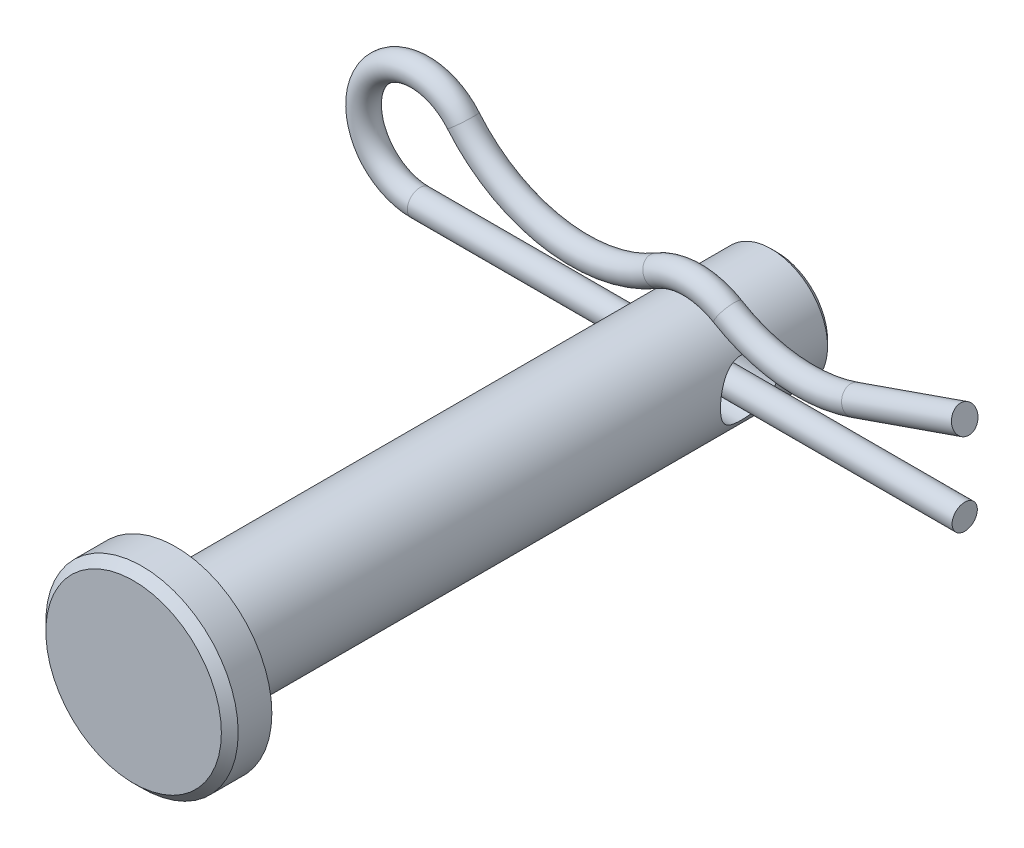
ISO-10303-21;
HEADER;
FILE_DESCRIPTION(('STEP AP214'),'2;1');
FILE_NAME('part.step','',(''),(''),'','','');
FILE_SCHEMA(('AUTOMOTIVE_DESIGN { 1 0 10303 214 1 1 1 1 }'));
ENDSEC;
DATA;
#1=APPLICATION_CONTEXT('core data for automotive mechanical design processes');
#2=APPLICATION_PROTOCOL_DEFINITION('international standard','automotive_design',2000,#1);
#3=PRODUCT_CONTEXT('',#1,'mechanical');
#4=PRODUCT('Part','Part','',(#3));
#5=PRODUCT_RELATED_PRODUCT_CATEGORY('part','',(#4));
#6=PRODUCT_DEFINITION_FORMATION('','',#4);
#7=PRODUCT_DEFINITION_CONTEXT('part definition',#1,'design');
#8=PRODUCT_DEFINITION('design','',#6,#7);
#9=PRODUCT_DEFINITION_SHAPE('','',#8);
#10=(LENGTH_UNIT() NAMED_UNIT(*) SI_UNIT(.MILLI.,.METRE.));
#11=(NAMED_UNIT(*) PLANE_ANGLE_UNIT() SI_UNIT($,.RADIAN.));
#12=(NAMED_UNIT(*) SI_UNIT($,.STERADIAN.) SOLID_ANGLE_UNIT());
#13=UNCERTAINTY_MEASURE_WITH_UNIT(LENGTH_MEASURE(1.E-05),#10,'distance_accuracy_value','');
#14=(GEOMETRIC_REPRESENTATION_CONTEXT(3) GLOBAL_UNCERTAINTY_ASSIGNED_CONTEXT((#13)) GLOBAL_UNIT_ASSIGNED_CONTEXT((#10,
#11,#12)) REPRESENTATION_CONTEXT('',''));
#15=CARTESIAN_POINT('',(0.,0.,0.));
#16=DIRECTION('',(0.,0.,1.));
#17=DIRECTION('',(1.,0.,0.));
#18=AXIS2_PLACEMENT_3D('',#15,#16,#17);
#19=CARTESIAN_POINT('',(6.8677417632059,1.95548396251024,-9.128125));
#20=DIRECTION('',(0.944376159944791,0.32886725061631,0.));
#21=DIRECTION('',(-0.32886725061631,0.944376159944791,0.));
#22=AXIS2_PLACEMENT_3D('',#19,#20,#21);
#23=CYLINDRICAL_SURFACE('',#22,0.533400000000001);
#24=CARTESIAN_POINT('',(6.8677417632059,1.95548396251024,-9.128125));
#25=DIRECTION('',(0.944376159944795,0.328867250616297,0.));
#26=DIRECTION('',(-0.328867250616297,0.944376159944795,0.));
#27=AXIS2_PLACEMENT_3D('',#24,#25,#26);
#28=CIRCLE('',#27,0.533400000000001);
#29=CARTESIAN_POINT('',(7.04315955468464,1.45175371879569,-9.128125));
#30=VERTEX_POINT('',#29);
#31=EDGE_CURVE('E46',#30,#30,#28,.T.);
#32=ORIENTED_EDGE('',*,*,#31,.T.);
#33=EDGE_LOOP('',(#32));
#34=FACE_BOUND('',#33,.T.);
#35=CARTESIAN_POINT('',(11.509375,3.57187500000001,-9.128125));
#36=DIRECTION('',(0.944376159944795,0.328867250616297,0.));
#37=DIRECTION('',(-0.328867250616297,0.944376159944795,0.));
#38=AXIS2_PLACEMENT_3D('',#35,#36,#37);
#39=CIRCLE('',#38,0.533400000000001);
#40=CARTESIAN_POINT('',(11.3339572085213,4.07560524371457,-9.128125));
#41=VERTEX_POINT('',#40);
#42=EDGE_CURVE('E11',#41,#41,#39,.T.);
#43=ORIENTED_EDGE('',*,*,#42,.F.);
#44=EDGE_LOOP('',(#43));
#45=FACE_BOUND('',#44,.T.);
#46=ADVANCED_FACE('F40',(#34,#45),#23,.T.);
#47=CARTESIAN_POINT('',(4.7671809277289,7.98746060907687,-9.128125));
#48=DIRECTION('',(0.,0.,1.));
#49=DIRECTION('',(1.,0.,0.));
#50=AXIS2_PLACEMENT_3D('',#47,#48,#49);
#51=TOROIDAL_SURFACE('',#50,6.38726060907687,0.533400000000001);
#52=CARTESIAN_POINT('',(1.49374300344779,2.50278174480932,-9.128125));
#53=DIRECTION('',(0.858690321242454,-0.5124948118806,0.));
#54=DIRECTION('',(0.5124948118806,0.858690321242454,0.));
#55=AXIS2_PLACEMENT_3D('',#52,#53,#54);
#56=CIRCLE('',#55,0.533400000000001);
#57=CARTESIAN_POINT('',(1.22037827079068,2.04475632745859,-9.128125));
#58=VERTEX_POINT('',#57);
#59=EDGE_CURVE('E50',#58,#58,#56,.T.);
#60=CARTESIAN_POINT('',(4.7671809277289,7.98746060907687,-9.128125));
#61=DIRECTION('',(0.,0.,1.));
#62=DIRECTION('',(1.,0.,0.));
#63=AXIS2_PLACEMENT_3D('',#60,#61,#62);
#64=CIRCLE('',#63,6.92066060907687);
#65=EDGE_CURVE('',#58,#30,#64,.T.);
#66=ORIENTED_EDGE('',*,*,#59,.T.);
#67=ORIENTED_EDGE('',*,*,#31,.F.);
#68=ORIENTED_EDGE('',*,*,#65,.T.);
#69=ORIENTED_EDGE('',*,*,#65,.F.);
#70=EDGE_LOOP('',(#66,#68,#67,#69));
#71=FACE_BOUND('',#70,.T.);
#72=ADVANCED_FACE('F87',(#71),#51,.T.);
#73=CARTESIAN_POINT('',(0.,0.,-9.128125));
#74=DIRECTION('',(0.,0.,-1.));
#75=DIRECTION('',(-1.,0.,0.));
#76=AXIS2_PLACEMENT_3D('',#73,#74,#75);
#77=TOROIDAL_SURFACE('',#76,2.91465,0.533400000000001);
#78=CARTESIAN_POINT('',(-1.49374300344773,2.50278174480936,-9.128125));
#79=DIRECTION('',(0.858690321242467,0.512494811880577,0.));
#80=DIRECTION('',(-0.512494811880577,0.858690321242467,0.));
#81=AXIS2_PLACEMENT_3D('',#78,#79,#80);
#82=CIRCLE('',#81,0.533400000000001);
#83=CARTESIAN_POINT('',(-1.22037827079062,2.04475632745863,-9.128125));
#84=VERTEX_POINT('',#83);
#85=EDGE_CURVE('E54',#84,#84,#82,.T.);
#86=ORIENTED_EDGE('',*,*,#85,.T.);
#87=EDGE_LOOP('',(#86));
#88=FACE_BOUND('',#87,.T.);
#89=ORIENTED_EDGE('',*,*,#59,.F.);
#90=EDGE_LOOP('',(#89));
#91=FACE_BOUND('',#90,.T.);
#92=ADVANCED_FACE('F91',(#88,#91),#77,.T.);
#93=CARTESIAN_POINT('',(-4.7671809277289,7.98746060907687,-9.128125));
#94=DIRECTION('',(0.,0.,1.));
#95=DIRECTION('',(1.,0.,0.));
#96=AXIS2_PLACEMENT_3D('',#93,#94,#95);
#97=TOROIDAL_SURFACE('',#96,6.38726060907687,0.533400000000001);
#98=CARTESIAN_POINT('',(-9.67840844816891,3.90371939167124,-9.128125));
#99=DIRECTION('',(0.639357224848815,-0.7689098380393,0.));
#100=DIRECTION('',(0.7689098380393,0.639357224848815,0.));
#101=AXIS2_PLACEMENT_3D('',#98,#99,#100);
#102=CIRCLE('',#101,0.533400000000001);
#103=CARTESIAN_POINT('',(-10.0885449557791,3.56268624793687,-9.128125));
#104=VERTEX_POINT('',#103);
#105=EDGE_CURVE('E59',#104,#104,#102,.T.);
#106=CARTESIAN_POINT('',(-4.7671809277289,7.98746060907687,-9.128125));
#107=DIRECTION('',(0.,0.,1.));
#108=DIRECTION('',(1.,0.,0.));
#109=AXIS2_PLACEMENT_3D('',#106,#107,#108);
#110=CIRCLE('',#109,6.92066060907687);
#111=EDGE_CURVE('',#104,#84,#110,.T.);
#112=ORIENTED_EDGE('',*,*,#105,.T.);
#113=ORIENTED_EDGE('',*,*,#85,.F.);
#114=ORIENTED_EDGE('',*,*,#111,.T.);
#115=ORIENTED_EDGE('',*,*,#111,.F.);
#116=EDGE_LOOP('',(#112,#114,#113,#115));
#117=FACE_BOUND('',#116,.T.);
#118=ADVANCED_FACE('F97',(#117),#97,.T.);
#119=CARTESIAN_POINT('',(-11.509375,2.38125,-9.128125));
#120=DIRECTION('',(0.,0.,-1.));
#121=DIRECTION('',(-1.,0.,0.));
#122=AXIS2_PLACEMENT_3D('',#119,#120,#121);
#123=TOROIDAL_SURFACE('',#122,2.38125,0.533400000000001);
#124=CARTESIAN_POINT('',(-11.509375,0.,-9.128125));
#125=DIRECTION('',(-1.,0.,0.));
#126=DIRECTION('',(0.,-1.,0.));
#127=AXIS2_PLACEMENT_3D('',#124,#125,#126);
#128=CIRCLE('',#127,0.533400000000001);
#129=CARTESIAN_POINT('',(-11.509375,-0.533400000000001,-9.128125));
#130=VERTEX_POINT('',#129);
#131=EDGE_CURVE('E62',#130,#130,#128,.T.);
#132=ORIENTED_EDGE('',*,*,#131,.T.);
#133=EDGE_LOOP('',(#132));
#134=FACE_BOUND('',#133,.T.);
#135=ORIENTED_EDGE('',*,*,#105,.F.);
#136=EDGE_LOOP('',(#135));
#137=FACE_BOUND('',#136,.T.);
#138=ADVANCED_FACE('F69',(#134,#137),#123,.T.);
#139=CARTESIAN_POINT('',(-11.509375,0.,-9.128125));
#140=DIRECTION('',(1.,0.,0.));
#141=DIRECTION('',(0.,0.,-1.));
#142=AXIS2_PLACEMENT_3D('',#139,#140,#141);
#143=CYLINDRICAL_SURFACE('',#142,0.533400000000001);
#144=ORIENTED_EDGE('',*,*,#131,.F.);
#145=EDGE_LOOP('',(#144));
#146=FACE_BOUND('',#145,.T.);
#147=CARTESIAN_POINT('',(11.509375,0.,-9.128125));
#148=DIRECTION('',(-1.,0.,0.));
#149=DIRECTION('',(0.,-1.,0.));
#150=AXIS2_PLACEMENT_3D('',#147,#148,#149);
#151=CIRCLE('',#150,0.533400000000001);
#152=CARTESIAN_POINT('',(11.509375,-0.533400000000001,-9.128125));
#153=VERTEX_POINT('',#152);
#154=EDGE_CURVE('E63',#153,#153,#151,.T.);
#155=ORIENTED_EDGE('',*,*,#154,.T.);
#156=EDGE_LOOP('',(#155));
#157=FACE_BOUND('',#156,.T.);
#158=ADVANCED_FACE('F72',(#146,#157),#143,.T.);
#159=CARTESIAN_POINT('',(11.509375,3.57187500000001,-9.128125));
#160=DIRECTION('',(0.944376159944795,0.328867250616297,0.));
#161=DIRECTION('',(-0.328867250616297,0.944376159944795,0.));
#162=AXIS2_PLACEMENT_3D('',#159,#160,#161);
#163=PLANE('',#162);
#164=ORIENTED_EDGE('',*,*,#42,.T.);
#165=EDGE_LOOP('',(#164));
#166=FACE_BOUND('',#165,.T.);
#167=ADVANCED_FACE('F75',(#166),#163,.T.);
#168=CARTESIAN_POINT('',(11.509375,0.,-9.128125));
#169=DIRECTION('',(-1.,0.,0.));
#170=DIRECTION('',(0.,-1.,0.));
#171=AXIS2_PLACEMENT_3D('',#168,#169,#170);
#172=PLANE('',#171);
#173=ORIENTED_EDGE('',*,*,#154,.F.);
#174=EDGE_LOOP('',(#173));
#175=FACE_BOUND('',#174,.T.);
#176=ADVANCED_FACE('F79',(#175),#172,.F.);
#177=CLOSED_SHELL('',(#46,#72,#92,#118,#138,#158,#167,#176));
#178=MANIFOLD_SOLID_BREP('B2',#177);
#179=CARTESIAN_POINT('',(0.,0.,12.7));
#180=DIRECTION('',(0.,0.,-1.));
#181=DIRECTION('',(-1.,0.,0.));
#182=AXIS2_PLACEMENT_3D('',#179,#180,#181);
#183=CYLINDRICAL_SURFACE('',#182,2.38125);
#184=CARTESIAN_POINT('',(0.,0.,-12.461875));
#185=DIRECTION('',(0.,0.,1.));
#186=DIRECTION('',(1.,0.,0.));
#187=AXIS2_PLACEMENT_3D('',#184,#185,#186);
#188=CIRCLE('',#187,2.38125);
#189=CARTESIAN_POINT('',(2.38125,0.,-12.461875));
#190=VERTEX_POINT('',#189);
#191=EDGE_CURVE('E162',#190,#190,#188,.T.);
#192=ORIENTED_EDGE('',*,*,#191,.T.);
#193=EDGE_LOOP('',(#192));
#194=FACE_BOUND('',#193,.T.);
#195=CARTESIAN_POINT('',(-2.38125,0.,-7.9375));
#196=CARTESIAN_POINT('',(-2.38124658771817,-0.0625934933908995,-7.93750393182415));
#197=CARTESIAN_POINT('',(-2.37875553370113,-0.12526160776547,-7.94246499331049));
#198=CARTESIAN_POINT('',(-2.36903604532025,-0.248745655116469,-7.9620898356559));
#199=CARTESIAN_POINT('',(-2.36179861446384,-0.309557840743265,-7.97677204291283));
#200=CARTESIAN_POINT('',(-2.34334382664568,-0.427355251873434,-8.01512137838437));
#201=CARTESIAN_POINT('',(-2.33214194770735,-0.484354349749462,-8.03875358874529));
#202=CARTESIAN_POINT('',(-2.30678565164099,-0.593493959385317,-8.09415127106263));
#203=CARTESIAN_POINT('',(-2.29263146732422,-0.645634853781903,-8.12591610174629));
#204=CARTESIAN_POINT('',(-2.26166669988499,-0.747126495522785,-8.19886272516843));
#205=CARTESIAN_POINT('',(-2.24474721461222,-0.796117610742265,-8.2404979643447));
#206=CARTESIAN_POINT('',(-2.2105140207503,-0.886753026544746,-8.3310271362285));
#207=CARTESIAN_POINT('',(-2.19320002298882,-0.928391728636494,-8.37992654851656));
#208=CARTESIAN_POINT('',(-2.15859063769341,-1.00637816303611,-8.48814423802628));
#209=CARTESIAN_POINT('',(-2.14140081986313,-1.04206516514117,-8.5479764170931));
#210=CARTESIAN_POINT('',(-2.11081118475794,-1.10271904514174,-8.67374360940859));
#211=CARTESIAN_POINT('',(-2.09740866244572,-1.12769358094429,-8.73967422201052));
#212=CARTESIAN_POINT('',(-2.07713897941891,-1.16458893898079,-8.87174189114298));
#213=CARTESIAN_POINT('',(-2.06992860854359,-1.1772017235864,-8.93763030074274));
#214=CARTESIAN_POINT('',(-2.06194687719966,-1.19113338890835,-9.07094980373119));
#215=CARTESIAN_POINT('',(-2.06116915374352,-1.19246343021919,-9.13837930647472));
#216=CARTESIAN_POINT('',(-2.06586451337536,-1.18429955128951,-9.26419679770049));
#217=CARTESIAN_POINT('',(-2.07060121735085,-1.17608099119853,-9.32270173717495));
#218=CARTESIAN_POINT('',(-2.0845013483624,-1.15126275778341,-9.43735639834728));
#219=CARTESIAN_POINT('',(-2.09366618546584,-1.13466041470314,-9.49350536362914));
#220=CARTESIAN_POINT('',(-2.1155915160392,-1.09324351977209,-9.60345718596099));
#221=CARTESIAN_POINT('',(-2.12843079040573,-1.06824668928498,-9.65717493105433));
#222=CARTESIAN_POINT('',(-2.15626240722546,-1.01089025937972,-9.75991145461498));
#223=CARTESIAN_POINT('',(-2.17125571566414,-0.97852735278922,-9.80892810832386));
#224=CARTESIAN_POINT('',(-2.204003536286,-0.90257239663054,-9.9074143665474));
#225=CARTESIAN_POINT('',(-2.22186710625626,-0.858076839495927,-9.95615334010161));
#226=CARTESIAN_POINT('',(-2.25680138992047,-0.761470860938948,-10.0457818577598));
#227=CARTESIAN_POINT('',(-2.27387172175947,-0.709356821108759,-10.0866676505153));
#228=CARTESIAN_POINT('',(-2.30626428608779,-0.595927464756045,-10.1612132401635));
#229=CARTESIAN_POINT('',(-2.3214685301789,-0.534297244998046,-10.1944493125057));
#230=CARTESIAN_POINT('',(-2.34741102209979,-0.405367587816348,-10.2498092752043));
#231=CARTESIAN_POINT('',(-2.35815281492167,-0.338072701740844,-10.2719419890337));
#232=CARTESIAN_POINT('',(-2.37320534860897,-0.205700104133523,-10.3026472775502));
#233=CARTESIAN_POINT('',(-2.37797504664999,-0.140900384809099,-10.312191127561));
#234=CARTESIAN_POINT('',(-2.38211931649743,-0.0104532111896992,-10.320493945507));
#235=CARTESIAN_POINT('',(-2.38149644415062,0.0551938267826013,-10.3192580225895));
#236=CARTESIAN_POINT('',(-2.37519200776753,0.180061757270823,-10.3065976616014));
#237=CARTESIAN_POINT('',(-2.36990626897501,0.239386357709477,-10.2959703282183));
#238=CARTESIAN_POINT('',(-2.35532022721706,0.35529070614697,-10.2660790456499));
#239=CARTESIAN_POINT('',(-2.34601948166815,0.411870150775843,-10.2468141443165));
#240=CARTESIAN_POINT('',(-2.323912493394,0.522551749435383,-10.199689325903));
#241=CARTESIAN_POINT('',(-2.31101362357334,0.576536816435452,-10.1715994059547));
#242=CARTESIAN_POINT('',(-2.28295169421308,0.679205558772778,-10.1078813403714));
#243=CARTESIAN_POINT('',(-2.26778767095513,0.727886962326195,-10.0722499834997));
#244=CARTESIAN_POINT('',(-2.23490101029919,0.823635905061684,-9.99042274358805));
#245=CARTESIAN_POINT('',(-2.21707334772675,0.870075505159961,-9.94353302224748));
#246=CARTESIAN_POINT('',(-2.18196785003363,0.954710182325452,-9.84258911676999));
#247=CARTESIAN_POINT('',(-2.1646904022613,0.992899556088159,-9.78853001790926));
#248=CARTESIAN_POINT('',(-2.13182825744162,1.06168973569882,-9.67147427421776));
#249=CARTESIAN_POINT('',(-2.11636605630571,1.0918334810305,-9.60817158617039));
#250=CARTESIAN_POINT('',(-2.090428799133,1.14071736472268,-9.47637082565359));
#251=CARTESIAN_POINT('',(-2.07994732092736,1.15947219672864,-9.40787957625952));
#252=CARTESIAN_POINT('',(-2.06646662138444,1.18331657161977,-9.27467876590559));
#253=CARTESIAN_POINT('',(-2.06284572182647,1.18954509883978,-9.21023734201106));
#254=CARTESIAN_POINT('',(-2.06175000375602,1.19144552443463,-9.08115833564985));
#255=CARTESIAN_POINT('',(-2.06427252119055,1.18712199863718,-9.01652085034461));
#256=CARTESIAN_POINT('',(-2.07451954503311,1.16910579328329,-8.89537745598845));
#257=CARTESIAN_POINT('',(-2.081725593681,1.1563448992644,-8.83868350273432));
#258=CARTESIAN_POINT('',(-2.09991741148739,1.12296816088622,-8.72830345780996));
#259=CARTESIAN_POINT('',(-2.11090439637645,1.10234978978715,-8.67461834007175));
#260=CARTESIAN_POINT('',(-2.13632093965266,1.05229312174863,-8.56778728679407));
#261=CARTESIAN_POINT('',(-2.15093219477964,1.02235532346272,-8.51491990438401));
#262=CARTESIAN_POINT('',(-2.18164566727434,0.955061000604868,-8.41461375535999));
#263=CARTESIAN_POINT('',(-2.19774865799103,0.917700616381016,-8.36717783335142));
#264=CARTESIAN_POINT('',(-2.23197328511557,0.831298335810089,-8.27308720225546));
#265=CARTESIAN_POINT('',(-2.25010245755217,0.781388641146486,-8.22722775625034));
#266=CARTESIAN_POINT('',(-2.28454448778714,0.674078066156022,-8.14435563536124));
#267=CARTESIAN_POINT('',(-2.30085636405197,0.616673173627612,-8.10734772899557));
#268=CARTESIAN_POINT('',(-2.33002942662263,0.49521855746375,-8.04318420558625));
#269=CARTESIAN_POINT('',(-2.34286539970213,0.431124721872151,-8.01610009829451));
#270=CARTESIAN_POINT('',(-2.36340659560876,0.298539814353397,-7.9734471500715));
#271=CARTESIAN_POINT('',(-2.37112639390897,0.230061848926332,-7.95784558236853));
#272=CARTESIAN_POINT('',(-2.37762409336193,0.134066692531779,-7.94476589493782));
#273=CARTESIAN_POINT('',(-2.37898025606987,0.107348987707653,-7.94204504322175));
#274=CARTESIAN_POINT('',(-2.3807939546427,0.0537587806828973,-7.93841122636905));
#275=CARTESIAN_POINT('',(-2.38125146570418,0.0268862742301636,-7.93749831113273));
#276=CARTESIAN_POINT('',(-2.38125,0.,-7.9375));
#277=B_SPLINE_CURVE_WITH_KNOTS('',3,(#195,#196,#197,#198,#199,#200,#201,#202,#203,#204,#205,
#206,#207,#208,#209,#210,#211,#212,#213,#214,#215,#216,#217,#218,#219,#220,#221,#222,#223,#224,
#225,#226,#227,#228,#229,#230,#231,#232,#233,#234,#235,#236,#237,#238,#239,#240,#241,#242,#243,
#244,#245,#246,#247,#248,#249,#250,#251,#252,#253,#254,#255,#256,#257,#258,#259,#260,#261,#262,
#263,#264,#265,#266,#267,#268,#269,#270,#271,#272,#273,#274,#275,#276),.UNSPECIFIED.,.T.,.F.,(4,
2,2,2,2,2,2,2,2,2,2,2,2,2,2,2,2,2,2,2,2,2,2,2,2,2,2,2,2,2,2,2,2,2,2,2,2,2,2,2,4),(0.,
0.187671381491036,0.375699515747514,0.563001503883018,0.750288727442429,0.948906406473725,
1.14767467670684,1.36185743031615,1.57588681716391,1.77710320704461,1.97812053569865,
2.15509926337347,2.33213438424011,2.51329317200605,2.69453345625452,2.89875445775649,
3.10307277131561,3.31687910824069,3.53051527011183,3.72645730217446,3.92230647121476,
4.10297598058852,4.28366541066828,4.46952119208217,4.65545627297242,4.85965036423511,
5.06398516445249,5.27821543446362,5.49216872029489,5.68558331740251,5.87891405645819,
6.0538272319698,6.22879670208067,6.41552156348466,6.60234377481072,6.81186617152194,
7.02150118957732,7.23261841267421,7.44313156831558,7.52374130413947,7.6043532648174),.UNSPECIFIED.);
#278=CARTESIAN_POINT('',(-2.38125,0.,-7.9375));
#279=VERTEX_POINT('',#278);
#280=EDGE_CURVE('E173',#279,#279,#277,.T.);
#281=ORIENTED_EDGE('',*,*,#280,.T.);
#282=EDGE_LOOP('',(#281));
#283=FACE_BOUND('',#282,.T.);
#284=CARTESIAN_POINT('',(2.38125,0.,-10.31875));
#285=CARTESIAN_POINT('',(2.38124658771817,-0.0625934933908995,-10.3187460681758));
#286=CARTESIAN_POINT('',(2.37875553370113,-0.12526160776547,-10.3137850066895));
#287=CARTESIAN_POINT('',(2.36903604532025,-0.248745655116469,-10.2941601643441));
#288=CARTESIAN_POINT('',(2.36179861446384,-0.309557840743266,-10.2794779570872));
#289=CARTESIAN_POINT('',(2.34334382664568,-0.427355251873434,-10.2411286216156));
#290=CARTESIAN_POINT('',(2.33214194770735,-0.48435434974946,-10.2174964112547));
#291=CARTESIAN_POINT('',(2.30678565164099,-0.593493959385315,-10.1620987289374));
#292=CARTESIAN_POINT('',(2.29263146732422,-0.645634853781903,-10.1303338982537));
#293=CARTESIAN_POINT('',(2.26166669988499,-0.747126495522785,-10.0573872748316));
#294=CARTESIAN_POINT('',(2.24474721461222,-0.796117610742265,-10.0157520356553));
#295=CARTESIAN_POINT('',(2.2105140207503,-0.886753026544746,-9.9252228637715));
#296=CARTESIAN_POINT('',(2.19320002298882,-0.928391728636495,-9.87632345148344));
#297=CARTESIAN_POINT('',(2.15859063769341,-1.00637816303611,-9.76810576197373));
#298=CARTESIAN_POINT('',(2.14140081986313,-1.04206516514117,-9.7082735829069));
#299=CARTESIAN_POINT('',(2.11081118475794,-1.10271904514174,-9.58250639059141));
#300=CARTESIAN_POINT('',(2.09740866244572,-1.12769358094429,-9.51657577798948));
#301=CARTESIAN_POINT('',(2.07713897941891,-1.16458893898079,-9.38450810885702));
#302=CARTESIAN_POINT('',(2.06992860854359,-1.1772017235864,-9.31861969925726));
#303=CARTESIAN_POINT('',(2.06194687719966,-1.19113338890835,-9.18530019626881));
#304=CARTESIAN_POINT('',(2.06116915374352,-1.19246343021919,-9.11787069352528));
#305=CARTESIAN_POINT('',(2.06586451337536,-1.18429955128951,-8.99205320229952));
#306=CARTESIAN_POINT('',(2.07060121735085,-1.17608099119853,-8.93354826282506));
#307=CARTESIAN_POINT('',(2.0845013483624,-1.15126275778341,-8.81889360165272));
#308=CARTESIAN_POINT('',(2.09366618546584,-1.13466041470314,-8.76274463637086));
#309=CARTESIAN_POINT('',(2.1155915160392,-1.09324351977209,-8.65279281403901));
#310=CARTESIAN_POINT('',(2.12843079040573,-1.06824668928498,-8.59907506894567));
#311=CARTESIAN_POINT('',(2.15626240722546,-1.01089025937972,-8.49633854538502));
#312=CARTESIAN_POINT('',(2.17125571566414,-0.97852735278922,-8.44732189167615));
#313=CARTESIAN_POINT('',(2.204003536286,-0.90257239663054,-8.3488356334526));
#314=CARTESIAN_POINT('',(2.22186710625626,-0.858076839495927,-8.30009665989839));
#315=CARTESIAN_POINT('',(2.25680138992047,-0.761470860938948,-8.21046814224021));
#316=CARTESIAN_POINT('',(2.27387172175947,-0.709356821108759,-8.16958234948466));
#317=CARTESIAN_POINT('',(2.30626428608779,-0.595927464756045,-8.09503675983648));
#318=CARTESIAN_POINT('',(2.3214685301789,-0.534297244998046,-8.06180068749429));
#319=CARTESIAN_POINT('',(2.34741102209979,-0.405367587816348,-8.00644072479567));
#320=CARTESIAN_POINT('',(2.35815281492167,-0.338072701740844,-7.98430801096632));
#321=CARTESIAN_POINT('',(2.37320534860897,-0.205700104133523,-7.95360272244983));
#322=CARTESIAN_POINT('',(2.37797504664999,-0.140900384809099,-7.94405887243899));
#323=CARTESIAN_POINT('',(2.38211931649743,-0.0104532111896992,-7.935756054493));
#324=CARTESIAN_POINT('',(2.38149644415062,0.0551938267826014,-7.9369919774105));
#325=CARTESIAN_POINT('',(2.37519200776753,0.180061757270823,-7.94965233839858));
#326=CARTESIAN_POINT('',(2.36990626897501,0.239386357709477,-7.96027967178169));
#327=CARTESIAN_POINT('',(2.35532022721706,0.35529070614697,-7.99017095435009));
#328=CARTESIAN_POINT('',(2.34601948166815,0.411870150775843,-8.00943585568353));
#329=CARTESIAN_POINT('',(2.323912493394,0.522551749435382,-8.05656067409699));
#330=CARTESIAN_POINT('',(2.31101362357334,0.576536816435451,-8.08465059404533));
#331=CARTESIAN_POINT('',(2.28295169421308,0.679205558772777,-8.14836865962857));
#332=CARTESIAN_POINT('',(2.26778767095513,0.727886962326195,-8.1840000165003));
#333=CARTESIAN_POINT('',(2.23490101029919,0.823635905061684,-8.26582725641195));
#334=CARTESIAN_POINT('',(2.21707334772675,0.870075505159961,-8.31271697775253));
#335=CARTESIAN_POINT('',(2.18196785003363,0.954710182325452,-8.41366088323002));
#336=CARTESIAN_POINT('',(2.1646904022613,0.992899556088159,-8.46771998209075));
#337=CARTESIAN_POINT('',(2.13182825744162,1.06168973569882,-8.58477572578225));
#338=CARTESIAN_POINT('',(2.11636605630571,1.0918334810305,-8.64807841382961));
#339=CARTESIAN_POINT('',(2.090428799133,1.14071736472268,-8.77987917434641));
#340=CARTESIAN_POINT('',(2.07994732092736,1.15947219672864,-8.84837042374048));
#341=CARTESIAN_POINT('',(2.06646662138444,1.18331657161977,-8.98157123409441));
#342=CARTESIAN_POINT('',(2.06284572182647,1.18954509883978,-9.04601265798895));
#343=CARTESIAN_POINT('',(2.06175000375602,1.19144552443463,-9.17509166435015));
#344=CARTESIAN_POINT('',(2.06427252119055,1.18712199863718,-9.23972914965539));
#345=CARTESIAN_POINT('',(2.07451954503311,1.16910579328329,-9.36087254401156));
#346=CARTESIAN_POINT('',(2.081725593681,1.1563448992644,-9.41756649726568));
#347=CARTESIAN_POINT('',(2.09991741148739,1.12296816088622,-9.52794654219004));
#348=CARTESIAN_POINT('',(2.11090439637645,1.10234978978715,-9.58163165992825));
#349=CARTESIAN_POINT('',(2.13632093965266,1.05229312174863,-9.68846271320593));
#350=CARTESIAN_POINT('',(2.15093219477964,1.02235532346272,-9.74133009561599));
#351=CARTESIAN_POINT('',(2.18164566727434,0.955061000604869,-9.84163624464001));
#352=CARTESIAN_POINT('',(2.19774865799103,0.917700616381016,-9.88907216664858));
#353=CARTESIAN_POINT('',(2.23197328511557,0.831298335810089,-9.98316279774454));
#354=CARTESIAN_POINT('',(2.25010245755217,0.781388641146486,-10.0290222437497));
#355=CARTESIAN_POINT('',(2.28454448778714,0.674078066156021,-10.1118943646388));
#356=CARTESIAN_POINT('',(2.30085636405197,0.616673173627611,-10.1489022710044));
#357=CARTESIAN_POINT('',(2.33002942662263,0.49521855746375,-10.2130657944138));
#358=CARTESIAN_POINT('',(2.34286539970213,0.431124721872151,-10.2401499017055));
#359=CARTESIAN_POINT('',(2.36340659560876,0.298539814353397,-10.2828028499285));
#360=CARTESIAN_POINT('',(2.37112639390897,0.230061848926332,-10.2984044176315));
#361=CARTESIAN_POINT('',(2.37762409336193,0.134066692531779,-10.3114841050622));
#362=CARTESIAN_POINT('',(2.37898025606987,0.107348987707653,-10.3142049567782));
#363=CARTESIAN_POINT('',(2.3807939546427,0.0537587806828973,-10.3178387736309));
#364=CARTESIAN_POINT('',(2.38125146570418,0.0268862742301636,-10.3187516888673));
#365=CARTESIAN_POINT('',(2.38125,0.,-10.31875));
#366=B_SPLINE_CURVE_WITH_KNOTS('',3,(#284,#285,#286,#287,#288,#289,#290,#291,#292,#293,#294,
#295,#296,#297,#298,#299,#300,#301,#302,#303,#304,#305,#306,#307,#308,#309,#310,#311,#312,#313,
#314,#315,#316,#317,#318,#319,#320,#321,#322,#323,#324,#325,#326,#327,#328,#329,#330,#331,#332,
#333,#334,#335,#336,#337,#338,#339,#340,#341,#342,#343,#344,#345,#346,#347,#348,#349,#350,#351,
#352,#353,#354,#355,#356,#357,#358,#359,#360,#361,#362,#363,#364,#365),.UNSPECIFIED.,.T.,.F.,(4,
2,2,2,2,2,2,2,2,2,2,2,2,2,2,2,2,2,2,2,2,2,2,2,2,2,2,2,2,2,2,2,2,2,2,2,2,2,2,2,4),(0.,
0.187671381491036,0.375699515747514,0.563001503883016,0.750288727442429,0.948906406473725,
1.14767467670684,1.36185743031615,1.57588681716391,1.77710320704461,1.97812053569865,
2.15509926337347,2.33213438424011,2.51329317200605,2.69453345625452,2.89875445775649,
3.10307277131561,3.31687910824069,3.53051527011183,3.72645730217446,3.92230647121476,
4.10297598058852,4.28366541066828,4.46952119208217,4.65545627297242,4.85965036423511,
5.06398516445249,5.27821543446362,5.49216872029489,5.68558331740251,5.87891405645819,
6.0538272319698,6.22879670208067,6.41552156348466,6.60234377481072,6.81186617152194,
7.02150118957732,7.23261841267421,7.44313156831558,7.52374130413947,7.6043532648174),.UNSPECIFIED.);
#367=CARTESIAN_POINT('',(2.38125,0.,-10.31875));
#368=VERTEX_POINT('',#367);
#369=EDGE_CURVE('E182',#368,#368,#366,.T.);
#370=ORIENTED_EDGE('',*,*,#369,.T.);
#371=EDGE_LOOP('',(#370));
#372=FACE_BOUND('',#371,.T.);
#373=CARTESIAN_POINT('',(0.,0.,12.7));
#374=DIRECTION('',(0.,0.,1.));
#375=DIRECTION('',(1.,0.,0.));
#376=AXIS2_PLACEMENT_3D('',#373,#374,#375);
#377=CIRCLE('',#376,2.38125);
#378=CARTESIAN_POINT('',(2.38125,0.,12.7));
#379=VERTEX_POINT('',#378);
#380=EDGE_CURVE('E221',#379,#379,#377,.T.);
#381=ORIENTED_EDGE('',*,*,#380,.F.);
#382=EDGE_LOOP('',(#381));
#383=FACE_BOUND('',#382,.T.);
#384=ADVANCED_FACE('F155',(#194,#283,#372,#383),#183,.T.);
#385=CARTESIAN_POINT('',(0.,0.,-12.7));
#386=DIRECTION('',(0.,0.,1.));
#387=DIRECTION('',(1.,0.,0.));
#388=AXIS2_PLACEMENT_3D('',#385,#386,#387);
#389=PLANE('',#388);
#390=CARTESIAN_POINT('',(0.,0.,-12.7));
#391=DIRECTION('',(0.,0.,1.));
#392=DIRECTION('',(1.,0.,0.));
#393=AXIS2_PLACEMENT_3D('',#390,#391,#392);
#394=CIRCLE('',#393,2.14312500000001);
#395=CARTESIAN_POINT('',(2.14312500000001,0.,-12.7));
#396=VERTEX_POINT('',#395);
#397=EDGE_CURVE('E39',#396,#396,#394,.F.);
#398=ORIENTED_EDGE('',*,*,#397,.T.);
#399=EDGE_LOOP('',(#398));
#400=FACE_BOUND('',#399,.T.);
#401=ADVANCED_FACE('F203',(#400),#389,.F.);
#402=CARTESIAN_POINT('',(0.,0.,12.7));
#403=DIRECTION('',(0.,0.,1.));
#404=DIRECTION('',(1.,0.,0.));
#405=AXIS2_PLACEMENT_3D('',#402,#403,#404);
#406=PLANE('',#405);
#407=CARTESIAN_POINT('',(0.,0.,12.7));
#408=DIRECTION('',(0.,0.,1.));
#409=DIRECTION('',(1.,0.,0.));
#410=AXIS2_PLACEMENT_3D('',#407,#408,#409);
#411=CIRCLE('',#410,4.064);
#412=CARTESIAN_POINT('',(4.064,0.,12.7));
#413=VERTEX_POINT('',#412);
#414=EDGE_CURVE('E181',#413,#413,#411,.T.);
#415=ORIENTED_EDGE('',*,*,#414,.F.);
#416=EDGE_LOOP('',(#415));
#417=FACE_BOUND('',#416,.T.);
#418=ORIENTED_EDGE('',*,*,#380,.T.);
#419=EDGE_LOOP('',(#418));
#420=FACE_BOUND('',#419,.T.);
#421=ADVANCED_FACE('F200',(#417,#420),#406,.F.);
#422=CARTESIAN_POINT('',(0.,0.,14.478));
#423=DIRECTION('',(0.,0.,-1.));
#424=DIRECTION('',(-1.,0.,0.));
#425=AXIS2_PLACEMENT_3D('',#422,#423,#424);
#426=CYLINDRICAL_SURFACE('',#425,4.064);
#427=CARTESIAN_POINT('',(0.,0.,14.1224));
#428=DIRECTION('',(0.,0.,1.));
#429=DIRECTION('',(1.,0.,0.));
#430=AXIS2_PLACEMENT_3D('',#427,#428,#429);
#431=CIRCLE('',#430,4.064);
#432=CARTESIAN_POINT('',(4.064,0.,14.1224));
#433=VERTEX_POINT('',#432);
#434=EDGE_CURVE('E166',#433,#433,#431,.F.);
#435=ORIENTED_EDGE('',*,*,#434,.T.);
#436=EDGE_LOOP('',(#435));
#437=FACE_BOUND('',#436,.T.);
#438=ORIENTED_EDGE('',*,*,#414,.T.);
#439=EDGE_LOOP('',(#438));
#440=FACE_BOUND('',#439,.T.);
#441=ADVANCED_FACE('F198',(#437,#440),#426,.T.);
#442=CARTESIAN_POINT('',(0.,0.,14.478));
#443=DIRECTION('',(0.,0.,1.));
#444=DIRECTION('',(1.,0.,0.));
#445=AXIS2_PLACEMENT_3D('',#442,#443,#444);
#446=PLANE('',#445);
#447=CARTESIAN_POINT('',(0.,0.,14.478));
#448=DIRECTION('',(0.,0.,1.));
#449=DIRECTION('',(1.,0.,0.));
#450=AXIS2_PLACEMENT_3D('',#447,#448,#449);
#451=CIRCLE('',#450,3.7084);
#452=CARTESIAN_POINT('',(3.7084,0.,14.478));
#453=VERTEX_POINT('',#452);
#454=EDGE_CURVE('E170',#453,#453,#451,.T.);
#455=ORIENTED_EDGE('',*,*,#454,.T.);
#456=EDGE_LOOP('',(#455));
#457=FACE_BOUND('',#456,.T.);
#458=ADVANCED_FACE('F194',(#457),#446,.T.);
#459=CARTESIAN_POINT('',(0.,0.,14.478));
#460=DIRECTION('',(0.,0.,-1.));
#461=DIRECTION('',(-1.,0.,0.));
#462=AXIS2_PLACEMENT_3D('',#459,#460,#461);
#463=CONICAL_SURFACE('',#462,3.7084,0.785398163397446);
#464=ORIENTED_EDGE('',*,*,#434,.F.);
#465=EDGE_LOOP('',(#464));
#466=FACE_BOUND('',#465,.T.);
#467=ORIENTED_EDGE('',*,*,#454,.F.);
#468=EDGE_LOOP('',(#467));
#469=FACE_BOUND('',#468,.T.);
#470=ADVANCED_FACE('F192',(#466,#469),#463,.T.);
#471=CARTESIAN_POINT('',(-4.064,0.,-9.128125));
#472=DIRECTION('',(1.,0.,0.));
#473=DIRECTION('',(0.,0.,-1.));
#474=AXIS2_PLACEMENT_3D('',#471,#472,#473);
#475=CYLINDRICAL_SURFACE('',#474,1.190625);
#476=ORIENTED_EDGE('',*,*,#369,.F.);
#477=EDGE_LOOP('',(#476));
#478=FACE_BOUND('',#477,.T.);
#479=ORIENTED_EDGE('',*,*,#280,.F.);
#480=EDGE_LOOP('',(#479));
#481=FACE_BOUND('',#480,.T.);
#482=ADVANCED_FACE('F188',(#478,#481),#475,.F.);
#483=CARTESIAN_POINT('',(0.,0.,-12.461875));
#484=DIRECTION('',(0.,0.,1.));
#485=DIRECTION('',(1.,0.,0.));
#486=AXIS2_PLACEMENT_3D('',#483,#484,#485);
#487=CONICAL_SURFACE('',#486,2.38125,0.785398163397446);
#488=ORIENTED_EDGE('',*,*,#397,.F.);
#489=EDGE_LOOP('',(#488));
#490=FACE_BOUND('',#489,.T.);
#491=ORIENTED_EDGE('',*,*,#191,.F.);
#492=EDGE_LOOP('',(#491));
#493=FACE_BOUND('',#492,.T.);
#494=ADVANCED_FACE('F157',(#490,#493),#487,.T.);
#495=CLOSED_SHELL('',(#384,#401,#421,#441,#458,#470,#482,#494));
#496=MANIFOLD_SOLID_BREP('B6',#495);
#497=ADVANCED_BREP_SHAPE_REPRESENTATION('',(#18,#178,#496),#14);
#498=SHAPE_DEFINITION_REPRESENTATION(#9,#497);
ENDSEC;
END-ISO-10303-21;
